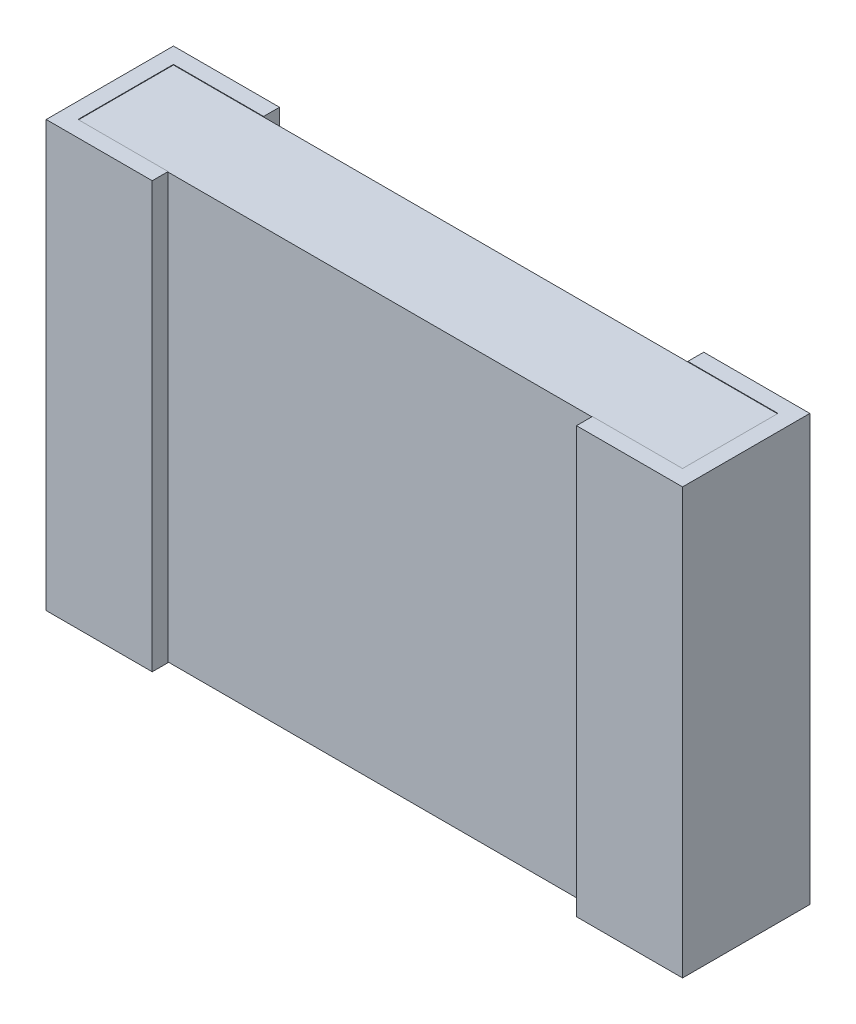
ISO-10303-21;
HEADER;
FILE_DESCRIPTION(('STEP AP214'),'2;1');
FILE_NAME('part.step','',(''),(''),'','','');
FILE_SCHEMA(('AUTOMOTIVE_DESIGN { 1 0 10303 214 1 1 1 1 }'));
ENDSEC;
DATA;
#1=APPLICATION_CONTEXT('core data for automotive mechanical design processes');
#2=APPLICATION_PROTOCOL_DEFINITION('international standard','automotive_design',2000,#1);
#3=PRODUCT_CONTEXT('',#1,'mechanical');
#4=PRODUCT('Part','Part','',(#3));
#5=PRODUCT_RELATED_PRODUCT_CATEGORY('part','',(#4));
#6=PRODUCT_DEFINITION_FORMATION('','',#4);
#7=PRODUCT_DEFINITION_CONTEXT('part definition',#1,'design');
#8=PRODUCT_DEFINITION('design','',#6,#7);
#9=PRODUCT_DEFINITION_SHAPE('','',#8);
#10=(LENGTH_UNIT() NAMED_UNIT(*) SI_UNIT(.MILLI.,.METRE.));
#11=(NAMED_UNIT(*) PLANE_ANGLE_UNIT() SI_UNIT($,.RADIAN.));
#12=(NAMED_UNIT(*) SI_UNIT($,.STERADIAN.) SOLID_ANGLE_UNIT());
#13=UNCERTAINTY_MEASURE_WITH_UNIT(LENGTH_MEASURE(1.E-05),#10,'distance_accuracy_value','');
#14=(GEOMETRIC_REPRESENTATION_CONTEXT(3) GLOBAL_UNCERTAINTY_ASSIGNED_CONTEXT((#13)) GLOBAL_UNIT_ASSIGNED_CONTEXT((#10,
#11,#12)) REPRESENTATION_CONTEXT('',''));
#15=CARTESIAN_POINT('',(0.,0.,0.));
#16=DIRECTION('',(0.,0.,1.));
#17=DIRECTION('',(1.,0.,0.));
#18=AXIS2_PLACEMENT_3D('',#15,#16,#17);
#19=CARTESIAN_POINT('',(0.0762,1.016,0.533400000000122));
#20=DIRECTION('',(0.,0.,-1.));
#21=DIRECTION('',(-1.,0.,0.));
#22=AXIS2_PLACEMENT_3D('',#19,#20,#21);
#23=PLANE('',#22);
#24=DIRECTION('',(0.,1.,0.));
#25=VECTOR('',#24,1.);
#26=CARTESIAN_POINT('',(2.54,-1.01854,0.533400000000122));
#27=LINE('',#26,#25);
#28=CARTESIAN_POINT('',(2.54,-1.016,0.533400000000122));
#29=VERTEX_POINT('',#28);
#30=CARTESIAN_POINT('',(2.54,1.016,0.533400000000122));
#31=VERTEX_POINT('',#30);
#32=EDGE_CURVE('E59',#29,#31,#27,.T.);
#33=ORIENTED_EDGE('',*,*,#32,.T.);
#34=DIRECTION('',(1.,0.,0.));
#35=VECTOR('',#34,1.);
#36=CARTESIAN_POINT('',(0.0762,1.016,0.533400000000122));
#37=LINE('',#36,#35);
#38=CARTESIAN_POINT('',(0.508,1.016,0.533400000000122));
#39=VERTEX_POINT('',#38);
#40=EDGE_CURVE('E43',#39,#31,#37,.T.);
#41=ORIENTED_EDGE('',*,*,#40,.F.);
#42=DIRECTION('',(0.,1.,0.));
#43=VECTOR('',#42,1.);
#44=CARTESIAN_POINT('',(0.508,-1.01854,0.533400000000122));
#45=LINE('',#44,#43);
#46=CARTESIAN_POINT('',(0.508,-1.016,0.533400000000122));
#47=VERTEX_POINT('',#46);
#48=EDGE_CURVE('E353',#47,#39,#45,.T.);
#49=ORIENTED_EDGE('',*,*,#48,.F.);
#50=DIRECTION('',(1.,0.,0.));
#51=VECTOR('',#50,1.);
#52=CARTESIAN_POINT('',(0.0762,-1.016,0.533400000000122));
#53=LINE('',#52,#51);
#54=EDGE_CURVE('E372',#47,#29,#53,.T.);
#55=ORIENTED_EDGE('',*,*,#54,.T.);
#56=EDGE_LOOP('',(#33,#41,#49,#55));
#57=FACE_BOUND('',#56,.T.);
#58=ADVANCED_FACE('F34',(#57),#23,.F.);
#59=CARTESIAN_POINT('',(2.9718,1.016,0.0762000000001228));
#60=DIRECTION('',(0.,0.,1.));
#61=DIRECTION('',(1.,0.,0.));
#62=AXIS2_PLACEMENT_3D('',#59,#60,#61);
#63=PLANE('',#62);
#64=DIRECTION('',(0.,1.,0.));
#65=VECTOR('',#64,1.);
#66=CARTESIAN_POINT('',(2.54000000000002,-1.01854,0.0762000000001225));
#67=LINE('',#66,#65);
#68=CARTESIAN_POINT('',(2.54000000000002,-1.016,0.0762000000001225));
#69=VERTEX_POINT('',#68);
#70=CARTESIAN_POINT('',(2.54000000000002,1.016,0.0762000000001228));
#71=VERTEX_POINT('',#70);
#72=EDGE_CURVE('E279',#69,#71,#67,.T.);
#73=ORIENTED_EDGE('',*,*,#72,.F.);
#74=DIRECTION('',(-1.,0.,0.));
#75=VECTOR('',#74,1.);
#76=CARTESIAN_POINT('',(2.9718,-1.016,0.0762000000001228));
#77=LINE('',#76,#75);
#78=CARTESIAN_POINT('',(0.507999999999976,-1.016,0.0762000000001225));
#79=VERTEX_POINT('',#78);
#80=EDGE_CURVE('E370',#69,#79,#77,.T.);
#81=ORIENTED_EDGE('',*,*,#80,.T.);
#82=DIRECTION('',(0.,1.,0.));
#83=VECTOR('',#82,1.);
#84=CARTESIAN_POINT('',(0.507999999999976,-1.01854,0.0762000000001225));
#85=LINE('',#84,#83);
#86=CARTESIAN_POINT('',(0.507999999999976,1.016,0.0762000000001225));
#87=VERTEX_POINT('',#86);
#88=EDGE_CURVE('E340',#79,#87,#85,.T.);
#89=ORIENTED_EDGE('',*,*,#88,.T.);
#90=DIRECTION('',(-1.,0.,0.));
#91=VECTOR('',#90,1.);
#92=CARTESIAN_POINT('',(2.9718,1.016,0.0762000000001228));
#93=LINE('',#92,#91);
#94=EDGE_CURVE('E51',#71,#87,#93,.T.);
#95=ORIENTED_EDGE('',*,*,#94,.F.);
#96=EDGE_LOOP('',(#73,#81,#89,#95));
#97=FACE_BOUND('',#96,.T.);
#98=ADVANCED_FACE('F36',(#97),#63,.F.);
#99=CARTESIAN_POINT('',(0.0762000000000002,1.016,0.0762000000001225));
#100=DIRECTION('',(0.,1.,0.));
#101=DIRECTION('',(0.,0.,1.));
#102=AXIS2_PLACEMENT_3D('',#99,#100,#101);
#103=PLANE('',#102);
#104=DIRECTION('',(0.,0.,-1.));
#105=VECTOR('',#104,1.);
#106=CARTESIAN_POINT('',(0.0762,1.016,0.533400000000122));
#107=LINE('',#106,#105);
#108=CARTESIAN_POINT('',(0.0762,1.016,0.533400000000122));
#109=VERTEX_POINT('',#108);
#110=CARTESIAN_POINT('',(0.0762000000000002,1.016,0.0762000000001224));
#111=VERTEX_POINT('',#110);
#112=EDGE_CURVE('E357',#109,#111,#107,.T.);
#113=ORIENTED_EDGE('',*,*,#112,.F.);
#114=EDGE_CURVE('E11',#109,#39,#37,.T.);
#115=ORIENTED_EDGE('',*,*,#114,.T.);
#116=ORIENTED_EDGE('',*,*,#40,.T.);
#117=DIRECTION('',(-1.,0.,0.));
#118=VECTOR('',#117,1.);
#119=CARTESIAN_POINT('',(0.0762000000000002,1.016,0.533400000000122));
#120=LINE('',#119,#118);
#121=CARTESIAN_POINT('',(2.9718,1.016,0.533400000000122));
#122=VERTEX_POINT('',#121);
#123=EDGE_CURVE('E210',#122,#31,#120,.T.);
#124=ORIENTED_EDGE('',*,*,#123,.F.);
#125=DIRECTION('',(0.,0.,1.));
#126=VECTOR('',#125,1.);
#127=CARTESIAN_POINT('',(2.9718,1.016,0.0762000000001228));
#128=LINE('',#127,#126);
#129=CARTESIAN_POINT('',(2.9718,1.016,0.0762000000001228));
#130=VERTEX_POINT('',#129);
#131=EDGE_CURVE('E361',#130,#122,#128,.T.);
#132=ORIENTED_EDGE('',*,*,#131,.F.);
#133=EDGE_CURVE('E359',#130,#71,#93,.T.);
#134=ORIENTED_EDGE('',*,*,#133,.T.);
#135=ORIENTED_EDGE('',*,*,#94,.T.);
#136=DIRECTION('',(-1.,0.,0.));
#137=VECTOR('',#136,1.);
#138=CARTESIAN_POINT('',(0.0762000000000002,1.016,0.0762000000001224));
#139=LINE('',#138,#137);
#140=EDGE_CURVE('E352',#87,#111,#139,.T.);
#141=ORIENTED_EDGE('',*,*,#140,.T.);
#142=EDGE_LOOP('',(#113,#115,#116,#124,#132,#134,#135,#141));
#143=FACE_BOUND('',#142,.T.);
#144=ADVANCED_FACE('F389',(#143),#103,.T.);
#145=CARTESIAN_POINT('',(0.0762000000000002,-1.016,0.0762000000001225));
#146=DIRECTION('',(0.,1.,0.));
#147=DIRECTION('',(0.,0.,1.));
#148=AXIS2_PLACEMENT_3D('',#145,#146,#147);
#149=PLANE('',#148);
#150=DIRECTION('',(0.,0.,-1.));
#151=VECTOR('',#150,1.);
#152=CARTESIAN_POINT('',(0.0762,-1.016,0.533400000000122));
#153=LINE('',#152,#151);
#154=CARTESIAN_POINT('',(0.0762,-1.016,0.533400000000122));
#155=VERTEX_POINT('',#154);
#156=CARTESIAN_POINT('',(0.0762000000000002,-1.016,0.0762000000001225));
#157=VERTEX_POINT('',#156);
#158=EDGE_CURVE('E356',#155,#157,#153,.T.);
#159=ORIENTED_EDGE('',*,*,#158,.T.);
#160=EDGE_CURVE('E366',#79,#157,#77,.T.);
#161=ORIENTED_EDGE('',*,*,#160,.F.);
#162=ORIENTED_EDGE('',*,*,#80,.F.);
#163=CARTESIAN_POINT('',(2.9718,-1.016,0.0762000000001228));
#164=VERTEX_POINT('',#163);
#165=EDGE_CURVE('E367',#164,#69,#77,.T.);
#166=ORIENTED_EDGE('',*,*,#165,.F.);
#167=DIRECTION('',(0.,0.,1.));
#168=VECTOR('',#167,1.);
#169=CARTESIAN_POINT('',(2.9718,-1.016,0.0762000000001228));
#170=LINE('',#169,#168);
#171=CARTESIAN_POINT('',(2.9718,-1.016,0.533400000000122));
#172=VERTEX_POINT('',#171);
#173=EDGE_CURVE('E369',#164,#172,#170,.T.);
#174=ORIENTED_EDGE('',*,*,#173,.T.);
#175=EDGE_CURVE('E206',#29,#172,#53,.T.);
#176=ORIENTED_EDGE('',*,*,#175,.F.);
#177=ORIENTED_EDGE('',*,*,#54,.F.);
#178=EDGE_CURVE('E38',#155,#47,#53,.T.);
#179=ORIENTED_EDGE('',*,*,#178,.F.);
#180=EDGE_LOOP('',(#159,#161,#162,#166,#174,#176,#177,#179));
#181=FACE_BOUND('',#180,.T.);
#182=ADVANCED_FACE('F386',(#181),#149,.F.);
#183=CARTESIAN_POINT('',(0.0762,-1.01854,0.533400000000122));
#184=DIRECTION('',(0.,0.,1.));
#185=DIRECTION('',(1.,0.,0.));
#186=AXIS2_PLACEMENT_3D('',#183,#184,#185);
#187=PLANE('',#186);
#188=DIRECTION('',(0.,1.,0.));
#189=VECTOR('',#188,1.);
#190=CARTESIAN_POINT('',(0.0762,-1.01854,0.533400000000122));
#191=LINE('',#190,#189);
#192=CARTESIAN_POINT('',(0.0762,-1.01854,0.533400000000122));
#193=VERTEX_POINT('',#192);
#194=EDGE_CURVE('E329',#193,#155,#191,.T.);
#195=ORIENTED_EDGE('',*,*,#194,.T.);
#196=ORIENTED_EDGE('',*,*,#178,.T.);
#197=CARTESIAN_POINT('',(0.508,-1.01854,0.533400000000122));
#198=VERTEX_POINT('',#197);
#199=EDGE_CURVE('E349',#198,#47,#45,.T.);
#200=ORIENTED_EDGE('',*,*,#199,.F.);
#201=DIRECTION('',(1.,0.,0.));
#202=VECTOR('',#201,1.);
#203=CARTESIAN_POINT('',(0.0762,-1.01854,0.533400000000122));
#204=LINE('',#203,#202);
#205=EDGE_CURVE('E284',#193,#198,#204,.T.);
#206=ORIENTED_EDGE('',*,*,#205,.F.);
#207=EDGE_LOOP('',(#195,#196,#200,#206));
#208=FACE_BOUND('',#207,.T.);
#209=ADVANCED_FACE('F376',(#208),#187,.F.);
#210=CARTESIAN_POINT('',(0.507999999999976,-1.01854,0.0762000000001225));
#211=DIRECTION('',(0.,0.,-1.));
#212=DIRECTION('',(-1.,0.,0.));
#213=AXIS2_PLACEMENT_3D('',#210,#211,#212);
#214=PLANE('',#213);
#215=CARTESIAN_POINT('',(0.507999999999976,-1.01854,0.0762000000001225));
#216=VERTEX_POINT('',#215);
#217=EDGE_CURVE('E336',#216,#79,#85,.T.);
#218=ORIENTED_EDGE('',*,*,#217,.T.);
#219=ORIENTED_EDGE('',*,*,#160,.T.);
#220=DIRECTION('',(0.,1.,0.));
#221=VECTOR('',#220,1.);
#222=CARTESIAN_POINT('',(0.0762000000000002,-1.01854,0.0762000000001224));
#223=LINE('',#222,#221);
#224=CARTESIAN_POINT('',(0.0762000000000002,-1.01854,0.0762000000001224));
#225=VERTEX_POINT('',#224);
#226=EDGE_CURVE('E333',#225,#157,#223,.T.);
#227=ORIENTED_EDGE('',*,*,#226,.F.);
#228=DIRECTION('',(-1.,0.,0.));
#229=VECTOR('',#228,1.);
#230=CARTESIAN_POINT('',(0.507999999999976,-1.01854,0.0762000000001225));
#231=LINE('',#230,#229);
#232=EDGE_CURVE('E302',#216,#225,#231,.T.);
#233=ORIENTED_EDGE('',*,*,#232,.F.);
#234=EDGE_LOOP('',(#218,#219,#227,#233));
#235=FACE_BOUND('',#234,.T.);
#236=ADVANCED_FACE('F395',(#235),#214,.F.);
#237=CARTESIAN_POINT('',(0.0762000000000002,-1.01854,0.0762000000001224));
#238=DIRECTION('',(-1.,0.,0.));
#239=DIRECTION('',(0.,0.,1.));
#240=AXIS2_PLACEMENT_3D('',#237,#238,#239);
#241=PLANE('',#240);
#242=ORIENTED_EDGE('',*,*,#226,.T.);
#243=ORIENTED_EDGE('',*,*,#158,.F.);
#244=ORIENTED_EDGE('',*,*,#194,.F.);
#245=DIRECTION('',(0.,0.,1.));
#246=VECTOR('',#245,1.);
#247=CARTESIAN_POINT('',(0.0762000000000002,-1.01854,0.0762000000001224));
#248=LINE('',#247,#246);
#249=EDGE_CURVE('E304',#225,#193,#248,.T.);
#250=ORIENTED_EDGE('',*,*,#249,.F.);
#251=EDGE_LOOP('',(#242,#243,#244,#250));
#252=FACE_BOUND('',#251,.T.);
#253=ADVANCED_FACE('F481',(#252),#241,.F.);
#254=ORIENTED_EDGE('',*,*,#114,.F.);
#255=CARTESIAN_POINT('',(0.0762,1.01854,0.533400000000122));
#256=VERTEX_POINT('',#255);
#257=EDGE_CURVE('E306',#109,#256,#191,.T.);
#258=ORIENTED_EDGE('',*,*,#257,.T.);
#259=DIRECTION('',(1.,0.,0.));
#260=VECTOR('',#259,1.);
#261=CARTESIAN_POINT('',(0.0762,1.01854,0.533400000000122));
#262=LINE('',#261,#260);
#263=CARTESIAN_POINT('',(0.508,1.01854,0.533400000000122));
#264=VERTEX_POINT('',#263);
#265=EDGE_CURVE('E283',#256,#264,#262,.T.);
#266=ORIENTED_EDGE('',*,*,#265,.T.);
#267=EDGE_CURVE('E348',#39,#264,#45,.T.);
#268=ORIENTED_EDGE('',*,*,#267,.F.);
#269=EDGE_LOOP('',(#254,#258,#266,#268));
#270=FACE_BOUND('',#269,.T.);
#271=ADVANCED_FACE('F397',(#270),#187,.F.);
#272=CARTESIAN_POINT('',(0.508,-1.01854,0.609599999999878));
#273=DIRECTION('',(1.,0.,0.));
#274=DIRECTION('',(0.,0.,-1.));
#275=AXIS2_PLACEMENT_3D('',#272,#273,#274);
#276=PLANE('',#275);
#277=DIRECTION('',(0.,0.,-1.));
#278=VECTOR('',#277,1.);
#279=CARTESIAN_POINT('',(0.508,1.01854,0.609599999999878));
#280=LINE('',#279,#278);
#281=CARTESIAN_POINT('',(0.508,1.01854,0.609599999999878));
#282=VERTEX_POINT('',#281);
#283=EDGE_CURVE('E309',#282,#264,#280,.T.);
#284=ORIENTED_EDGE('',*,*,#283,.F.);
#285=DIRECTION('',(0.,1.,0.));
#286=VECTOR('',#285,1.);
#287=CARTESIAN_POINT('',(0.508,-1.01854,0.609599999999878));
#288=LINE('',#287,#286);
#289=CARTESIAN_POINT('',(0.508,-1.01854,0.609599999999878));
#290=VERTEX_POINT('',#289);
#291=EDGE_CURVE('E346',#290,#282,#288,.T.);
#292=ORIENTED_EDGE('',*,*,#291,.F.);
#293=DIRECTION('',(0.,0.,-1.));
#294=VECTOR('',#293,1.);
#295=CARTESIAN_POINT('',(0.508,-1.01854,0.609599999999878));
#296=LINE('',#295,#294);
#297=EDGE_CURVE('E286',#290,#198,#296,.T.);
#298=ORIENTED_EDGE('',*,*,#297,.T.);
#299=ORIENTED_EDGE('',*,*,#199,.T.);
#300=ORIENTED_EDGE('',*,*,#48,.T.);
#301=ORIENTED_EDGE('',*,*,#267,.T.);
#302=EDGE_LOOP('',(#284,#292,#298,#299,#300,#301));
#303=FACE_BOUND('',#302,.T.);
#304=ADVANCED_FACE('F384',(#303),#276,.T.);
#305=CARTESIAN_POINT('',(0.,-1.01854,0.609599999999878));
#306=DIRECTION('',(0.,0.,1.));
#307=DIRECTION('',(1.,0.,0.));
#308=AXIS2_PLACEMENT_3D('',#305,#306,#307);
#309=PLANE('',#308);
#310=DIRECTION('',(1.,0.,0.));
#311=VECTOR('',#310,1.);
#312=CARTESIAN_POINT('',(0.,1.01854,0.609599999999878));
#313=LINE('',#312,#311);
#314=CARTESIAN_POINT('',(0.,1.01854,0.609599999999878));
#315=VERTEX_POINT('',#314);
#316=EDGE_CURVE('E312',#315,#282,#313,.T.);
#317=ORIENTED_EDGE('',*,*,#316,.F.);
#318=DIRECTION('',(0.,1.,0.));
#319=VECTOR('',#318,1.);
#320=CARTESIAN_POINT('',(0.,-1.01854,0.609599999999878));
#321=LINE('',#320,#319);
#322=CARTESIAN_POINT('',(0.,-1.01854,0.609599999999878));
#323=VERTEX_POINT('',#322);
#324=EDGE_CURVE('E344',#323,#315,#321,.T.);
#325=ORIENTED_EDGE('',*,*,#324,.F.);
#326=DIRECTION('',(1.,0.,0.));
#327=VECTOR('',#326,1.);
#328=CARTESIAN_POINT('',(0.,-1.01854,0.609599999999878));
#329=LINE('',#328,#327);
#330=EDGE_CURVE('E290',#323,#290,#329,.T.);
#331=ORIENTED_EDGE('',*,*,#330,.T.);
#332=ORIENTED_EDGE('',*,*,#291,.T.);
#333=EDGE_LOOP('',(#317,#325,#331,#332));
#334=FACE_BOUND('',#333,.T.);
#335=ADVANCED_FACE('F496',(#334),#309,.T.);
#336=CARTESIAN_POINT('',(0.,-1.01854,0.));
#337=DIRECTION('',(-1.,0.,0.));
#338=DIRECTION('',(0.,0.,1.));
#339=AXIS2_PLACEMENT_3D('',#336,#337,#338);
#340=PLANE('',#339);
#341=DIRECTION('',(0.,0.,1.));
#342=VECTOR('',#341,1.);
#343=CARTESIAN_POINT('',(0.,1.01854,0.));
#344=LINE('',#343,#342);
#345=CARTESIAN_POINT('',(0.,1.01854,0.));
#346=VERTEX_POINT('',#345);
#347=EDGE_CURVE('E315',#346,#315,#344,.T.);
#348=ORIENTED_EDGE('',*,*,#347,.F.);
#349=DIRECTION('',(0.,1.,0.));
#350=VECTOR('',#349,1.);
#351=CARTESIAN_POINT('',(0.,-1.01854,0.));
#352=LINE('',#351,#350);
#353=CARTESIAN_POINT('',(0.,-1.01854,0.));
#354=VERTEX_POINT('',#353);
#355=EDGE_CURVE('E342',#354,#346,#352,.T.);
#356=ORIENTED_EDGE('',*,*,#355,.F.);
#357=DIRECTION('',(0.,0.,1.));
#358=VECTOR('',#357,1.);
#359=CARTESIAN_POINT('',(0.,-1.01854,0.));
#360=LINE('',#359,#358);
#361=EDGE_CURVE('E293',#354,#323,#360,.T.);
#362=ORIENTED_EDGE('',*,*,#361,.T.);
#363=ORIENTED_EDGE('',*,*,#324,.T.);
#364=EDGE_LOOP('',(#348,#356,#362,#363));
#365=FACE_BOUND('',#364,.T.);
#366=ADVANCED_FACE('F492',(#365),#340,.T.);
#367=CARTESIAN_POINT('',(0.507999999999976,-1.01854,0.));
#368=DIRECTION('',(0.,0.,-1.));
#369=DIRECTION('',(-1.,0.,0.));
#370=AXIS2_PLACEMENT_3D('',#367,#368,#369);
#371=PLANE('',#370);
#372=DIRECTION('',(-1.,0.,0.));
#373=VECTOR('',#372,1.);
#374=CARTESIAN_POINT('',(0.507999999999976,1.01854,0.));
#375=LINE('',#374,#373);
#376=CARTESIAN_POINT('',(0.507999999999976,1.01854,0.));
#377=VERTEX_POINT('',#376);
#378=EDGE_CURVE('E318',#377,#346,#375,.T.);
#379=ORIENTED_EDGE('',*,*,#378,.F.);
#380=DIRECTION('',(0.,1.,0.));
#381=VECTOR('',#380,1.);
#382=CARTESIAN_POINT('',(0.507999999999976,-1.01854,0.));
#383=LINE('',#382,#381);
#384=CARTESIAN_POINT('',(0.507999999999976,-1.01854,0.));
#385=VERTEX_POINT('',#384);
#386=EDGE_CURVE('E339',#385,#377,#383,.T.);
#387=ORIENTED_EDGE('',*,*,#386,.F.);
#388=DIRECTION('',(-1.,0.,0.));
#389=VECTOR('',#388,1.);
#390=CARTESIAN_POINT('',(0.507999999999976,-1.01854,0.));
#391=LINE('',#390,#389);
#392=EDGE_CURVE('E296',#385,#354,#391,.T.);
#393=ORIENTED_EDGE('',*,*,#392,.T.);
#394=ORIENTED_EDGE('',*,*,#355,.T.);
#395=EDGE_LOOP('',(#379,#387,#393,#394));
#396=FACE_BOUND('',#395,.T.);
#397=ADVANCED_FACE('F488',(#396),#371,.T.);
#398=CARTESIAN_POINT('',(0.507999999999976,-1.01854,0.0762000000001225));
#399=DIRECTION('',(1.,0.,0.));
#400=DIRECTION('',(0.,0.,-1.));
#401=AXIS2_PLACEMENT_3D('',#398,#399,#400);
#402=PLANE('',#401);
#403=DIRECTION('',(0.,0.,-1.));
#404=VECTOR('',#403,1.);
#405=CARTESIAN_POINT('',(0.507999999999976,1.01854,0.0762000000001225));
#406=LINE('',#405,#404);
#407=CARTESIAN_POINT('',(0.507999999999976,1.01854,0.0762000000001225));
#408=VERTEX_POINT('',#407);
#409=EDGE_CURVE('E321',#408,#377,#406,.T.);
#410=ORIENTED_EDGE('',*,*,#409,.F.);
#411=EDGE_CURVE('E335',#87,#408,#85,.T.);
#412=ORIENTED_EDGE('',*,*,#411,.F.);
#413=ORIENTED_EDGE('',*,*,#88,.F.);
#414=ORIENTED_EDGE('',*,*,#217,.F.);
#415=DIRECTION('',(0.,0.,-1.));
#416=VECTOR('',#415,1.);
#417=CARTESIAN_POINT('',(0.507999999999976,-1.01854,0.0762000000001225));
#418=LINE('',#417,#416);
#419=EDGE_CURVE('E299',#216,#385,#418,.T.);
#420=ORIENTED_EDGE('',*,*,#419,.T.);
#421=ORIENTED_EDGE('',*,*,#386,.T.);
#422=EDGE_LOOP('',(#410,#412,#413,#414,#420,#421));
#423=FACE_BOUND('',#422,.T.);
#424=ADVANCED_FACE('F484',(#423),#402,.T.);
#425=ORIENTED_EDGE('',*,*,#140,.F.);
#426=ORIENTED_EDGE('',*,*,#411,.T.);
#427=DIRECTION('',(-1.,0.,0.));
#428=VECTOR('',#427,1.);
#429=CARTESIAN_POINT('',(0.507999999999976,1.01854,0.0762000000001225));
#430=LINE('',#429,#428);
#431=CARTESIAN_POINT('',(0.0762000000000002,1.01854,0.0762000000001224));
#432=VERTEX_POINT('',#431);
#433=EDGE_CURVE('E324',#408,#432,#430,.T.);
#434=ORIENTED_EDGE('',*,*,#433,.T.);
#435=EDGE_CURVE('E332',#111,#432,#223,.T.);
#436=ORIENTED_EDGE('',*,*,#435,.F.);
#437=EDGE_LOOP('',(#425,#426,#434,#436));
#438=FACE_BOUND('',#437,.T.);
#439=ADVANCED_FACE('F479',(#438),#214,.F.);
#440=ORIENTED_EDGE('',*,*,#112,.T.);
#441=ORIENTED_EDGE('',*,*,#435,.T.);
#442=DIRECTION('',(0.,0.,1.));
#443=VECTOR('',#442,1.);
#444=CARTESIAN_POINT('',(0.0762000000000002,1.01854,0.0762000000001224));
#445=LINE('',#444,#443);
#446=EDGE_CURVE('E287',#432,#256,#445,.T.);
#447=ORIENTED_EDGE('',*,*,#446,.T.);
#448=ORIENTED_EDGE('',*,*,#257,.F.);
#449=EDGE_LOOP('',(#440,#441,#447,#448));
#450=FACE_BOUND('',#449,.T.);
#451=ADVANCED_FACE('F472',(#450),#241,.F.);
#452=CARTESIAN_POINT('',(0.508,-1.01854,0.533400000000122));
#453=DIRECTION('',(0.,1.,0.));
#454=DIRECTION('',(0.,0.,1.));
#455=AXIS2_PLACEMENT_3D('',#452,#453,#454);
#456=PLANE('',#455);
#457=ORIENTED_EDGE('',*,*,#205,.T.);
#458=ORIENTED_EDGE('',*,*,#297,.F.);
#459=ORIENTED_EDGE('',*,*,#330,.F.);
#460=ORIENTED_EDGE('',*,*,#361,.F.);
#461=ORIENTED_EDGE('',*,*,#392,.F.);
#462=ORIENTED_EDGE('',*,*,#419,.F.);
#463=ORIENTED_EDGE('',*,*,#232,.T.);
#464=ORIENTED_EDGE('',*,*,#249,.T.);
#465=EDGE_LOOP('',(#457,#458,#459,#460,#461,#462,#463,#464));
#466=FACE_BOUND('',#465,.T.);
#467=ADVANCED_FACE('F469',(#466),#456,.F.);
#468=CARTESIAN_POINT('',(0.508,1.01854,0.533400000000122));
#469=DIRECTION('',(0.,1.,0.));
#470=DIRECTION('',(0.,0.,1.));
#471=AXIS2_PLACEMENT_3D('',#468,#469,#470);
#472=PLANE('',#471);
#473=ORIENTED_EDGE('',*,*,#265,.F.);
#474=ORIENTED_EDGE('',*,*,#446,.F.);
#475=ORIENTED_EDGE('',*,*,#433,.F.);
#476=ORIENTED_EDGE('',*,*,#409,.T.);
#477=ORIENTED_EDGE('',*,*,#378,.T.);
#478=ORIENTED_EDGE('',*,*,#347,.T.);
#479=ORIENTED_EDGE('',*,*,#316,.T.);
#480=ORIENTED_EDGE('',*,*,#283,.T.);
#481=EDGE_LOOP('',(#473,#474,#475,#476,#477,#478,#479,#480));
#482=FACE_BOUND('',#481,.T.);
#483=ADVANCED_FACE('F467',(#482),#472,.T.);
#484=CARTESIAN_POINT('',(2.9718,-1.01854,0.533400000000122));
#485=DIRECTION('',(0.,0.,-1.));
#486=DIRECTION('',(-1.,0.,0.));
#487=AXIS2_PLACEMENT_3D('',#484,#485,#486);
#488=PLANE('',#487);
#489=ORIENTED_EDGE('',*,*,#175,.T.);
#490=DIRECTION('',(0.,1.,0.));
#491=VECTOR('',#490,1.);
#492=CARTESIAN_POINT('',(2.9718,-1.01854,0.533400000000122));
#493=LINE('',#492,#491);
#494=CARTESIAN_POINT('',(2.9718,-1.01854,0.533400000000122));
#495=VERTEX_POINT('',#494);
#496=EDGE_CURVE('E201',#495,#172,#493,.T.);
#497=ORIENTED_EDGE('',*,*,#496,.F.);
#498=DIRECTION('',(-1.,0.,0.));
#499=VECTOR('',#498,1.);
#500=CARTESIAN_POINT('',(2.9718,-1.01854,0.533400000000122));
#501=LINE('',#500,#499);
#502=CARTESIAN_POINT('',(2.54,-1.01854,0.533400000000122));
#503=VERTEX_POINT('',#502);
#504=EDGE_CURVE('E205',#495,#503,#501,.T.);
#505=ORIENTED_EDGE('',*,*,#504,.T.);
#506=EDGE_CURVE('E260',#503,#29,#27,.T.);
#507=ORIENTED_EDGE('',*,*,#506,.T.);
#508=EDGE_LOOP('',(#489,#497,#505,#507));
#509=FACE_BOUND('',#508,.T.);
#510=ADVANCED_FACE('F203',(#509),#488,.T.);
#511=CARTESIAN_POINT('',(2.9718,-1.01854,0.0762000000001224));
#512=DIRECTION('',(-1.,0.,0.));
#513=DIRECTION('',(0.,0.,1.));
#514=AXIS2_PLACEMENT_3D('',#511,#512,#513);
#515=PLANE('',#514);
#516=ORIENTED_EDGE('',*,*,#173,.F.);
#517=DIRECTION('',(0.,1.,0.));
#518=VECTOR('',#517,1.);
#519=CARTESIAN_POINT('',(2.9718,-1.01854,0.0762000000001224));
#520=LINE('',#519,#518);
#521=CARTESIAN_POINT('',(2.9718,-1.01854,0.0762000000001224));
#522=VERTEX_POINT('',#521);
#523=EDGE_CURVE('E226',#522,#164,#520,.T.);
#524=ORIENTED_EDGE('',*,*,#523,.F.);
#525=DIRECTION('',(0.,0.,1.));
#526=VECTOR('',#525,1.);
#527=CARTESIAN_POINT('',(2.9718,-1.01854,0.0762000000001224));
#528=LINE('',#527,#526);
#529=EDGE_CURVE('E217',#522,#495,#528,.T.);
#530=ORIENTED_EDGE('',*,*,#529,.T.);
#531=ORIENTED_EDGE('',*,*,#496,.T.);
#532=EDGE_LOOP('',(#516,#524,#530,#531));
#533=FACE_BOUND('',#532,.T.);
#534=ADVANCED_FACE('F224',(#533),#515,.T.);
#535=CARTESIAN_POINT('',(2.54000000000002,-1.01854,0.0762000000001225));
#536=DIRECTION('',(0.,0.,1.));
#537=DIRECTION('',(1.,0.,0.));
#538=AXIS2_PLACEMENT_3D('',#535,#536,#537);
#539=PLANE('',#538);
#540=ORIENTED_EDGE('',*,*,#165,.T.);
#541=CARTESIAN_POINT('',(2.54000000000002,-1.01854,0.0762000000001225));
#542=VERTEX_POINT('',#541);
#543=EDGE_CURVE('E275',#542,#69,#67,.T.);
#544=ORIENTED_EDGE('',*,*,#543,.F.);
#545=DIRECTION('',(1.,0.,0.));
#546=VECTOR('',#545,1.);
#547=CARTESIAN_POINT('',(2.54000000000002,-1.01854,0.0762000000001225));
#548=LINE('',#547,#546);
#549=EDGE_CURVE('E227',#542,#522,#548,.T.);
#550=ORIENTED_EDGE('',*,*,#549,.T.);
#551=ORIENTED_EDGE('',*,*,#523,.T.);
#552=EDGE_LOOP('',(#540,#544,#550,#551));
#553=FACE_BOUND('',#552,.T.);
#554=ADVANCED_FACE('F410',(#553),#539,.T.);
#555=CARTESIAN_POINT('',(2.9718,1.01854,0.533400000000122));
#556=VERTEX_POINT('',#555);
#557=EDGE_CURVE('E211',#122,#556,#493,.T.);
#558=ORIENTED_EDGE('',*,*,#557,.F.);
#559=ORIENTED_EDGE('',*,*,#123,.T.);
#560=CARTESIAN_POINT('',(2.54,1.01854,0.533400000000122));
#561=VERTEX_POINT('',#560);
#562=EDGE_CURVE('E240',#31,#561,#27,.T.);
#563=ORIENTED_EDGE('',*,*,#562,.T.);
#564=DIRECTION('',(-1.,0.,0.));
#565=VECTOR('',#564,1.);
#566=CARTESIAN_POINT('',(2.9718,1.01854,0.533400000000122));
#567=LINE('',#566,#565);
#568=EDGE_CURVE('E241',#556,#561,#567,.T.);
#569=ORIENTED_EDGE('',*,*,#568,.F.);
#570=EDGE_LOOP('',(#558,#559,#563,#569));
#571=FACE_BOUND('',#570,.T.);
#572=ADVANCED_FACE('F436',(#571),#488,.T.);
#573=CARTESIAN_POINT('',(2.9718,1.01854,0.0762000000001224));
#574=VERTEX_POINT('',#573);
#575=EDGE_CURVE('E278',#130,#574,#520,.T.);
#576=ORIENTED_EDGE('',*,*,#575,.F.);
#577=ORIENTED_EDGE('',*,*,#131,.T.);
#578=ORIENTED_EDGE('',*,*,#557,.T.);
#579=DIRECTION('',(0.,0.,1.));
#580=VECTOR('',#579,1.);
#581=CARTESIAN_POINT('',(2.9718,1.01854,0.0762000000001224));
#582=LINE('',#581,#580);
#583=EDGE_CURVE('E244',#574,#556,#582,.T.);
#584=ORIENTED_EDGE('',*,*,#583,.F.);
#585=EDGE_LOOP('',(#576,#577,#578,#584));
#586=FACE_BOUND('',#585,.T.);
#587=ADVANCED_FACE('F444',(#586),#515,.T.);
#588=CARTESIAN_POINT('',(2.54000000000002,1.01854,0.0762000000001225));
#589=VERTEX_POINT('',#588);
#590=EDGE_CURVE('E274',#71,#589,#67,.T.);
#591=ORIENTED_EDGE('',*,*,#590,.F.);
#592=ORIENTED_EDGE('',*,*,#133,.F.);
#593=ORIENTED_EDGE('',*,*,#575,.T.);
#594=DIRECTION('',(1.,0.,0.));
#595=VECTOR('',#594,1.);
#596=CARTESIAN_POINT('',(2.54000000000002,1.01854,0.0762000000001225));
#597=LINE('',#596,#595);
#598=EDGE_CURVE('E247',#589,#574,#597,.T.);
#599=ORIENTED_EDGE('',*,*,#598,.F.);
#600=EDGE_LOOP('',(#591,#592,#593,#599));
#601=FACE_BOUND('',#600,.T.);
#602=ADVANCED_FACE('F449',(#601),#539,.T.);
#603=CARTESIAN_POINT('',(2.54000000000002,-1.01854,0.0762000000001225));
#604=DIRECTION('',(1.,0.,0.));
#605=DIRECTION('',(0.,0.,-1.));
#606=AXIS2_PLACEMENT_3D('',#603,#604,#605);
#607=PLANE('',#606);
#608=DIRECTION('',(0.,0.,-1.));
#609=VECTOR('',#608,1.);
#610=CARTESIAN_POINT('',(2.54000000000002,1.01854,0.0762000000001225));
#611=LINE('',#610,#609);
#612=CARTESIAN_POINT('',(2.54000000000002,1.01854,0.));
#613=VERTEX_POINT('',#612);
#614=EDGE_CURVE('E250',#589,#613,#611,.T.);
#615=ORIENTED_EDGE('',*,*,#614,.T.);
#616=DIRECTION('',(0.,1.,0.));
#617=VECTOR('',#616,1.);
#618=CARTESIAN_POINT('',(2.54000000000002,-1.01854,0.));
#619=LINE('',#618,#617);
#620=CARTESIAN_POINT('',(2.54000000000002,-1.01854,0.));
#621=VERTEX_POINT('',#620);
#622=EDGE_CURVE('E271',#621,#613,#619,.T.);
#623=ORIENTED_EDGE('',*,*,#622,.F.);
#624=DIRECTION('',(0.,0.,-1.));
#625=VECTOR('',#624,1.);
#626=CARTESIAN_POINT('',(2.54000000000002,-1.01854,0.0762000000001225));
#627=LINE('',#626,#625);
#628=EDGE_CURVE('E229',#542,#621,#627,.T.);
#629=ORIENTED_EDGE('',*,*,#628,.F.);
#630=ORIENTED_EDGE('',*,*,#543,.T.);
#631=ORIENTED_EDGE('',*,*,#72,.T.);
#632=ORIENTED_EDGE('',*,*,#590,.T.);
#633=EDGE_LOOP('',(#615,#623,#629,#630,#631,#632));
#634=FACE_BOUND('',#633,.T.);
#635=ADVANCED_FACE('F412',(#634),#607,.F.);
#636=CARTESIAN_POINT('',(2.54000000000002,-1.01854,0.));
#637=DIRECTION('',(0.,0.,1.));
#638=DIRECTION('',(1.,0.,0.));
#639=AXIS2_PLACEMENT_3D('',#636,#637,#638);
#640=PLANE('',#639);
#641=DIRECTION('',(1.,0.,0.));
#642=VECTOR('',#641,1.);
#643=CARTESIAN_POINT('',(2.54000000000002,1.01854,0.));
#644=LINE('',#643,#642);
#645=CARTESIAN_POINT('',(3.048,1.01854,0.));
#646=VERTEX_POINT('',#645);
#647=EDGE_CURVE('E252',#613,#646,#644,.T.);
#648=ORIENTED_EDGE('',*,*,#647,.T.);
#649=DIRECTION('',(0.,1.,0.));
#650=VECTOR('',#649,1.);
#651=CARTESIAN_POINT('',(3.048,-1.01854,0.));
#652=LINE('',#651,#650);
#653=CARTESIAN_POINT('',(3.048,-1.01854,0.));
#654=VERTEX_POINT('',#653);
#655=EDGE_CURVE('E268',#654,#646,#652,.T.);
#656=ORIENTED_EDGE('',*,*,#655,.F.);
#657=DIRECTION('',(1.,0.,0.));
#658=VECTOR('',#657,1.);
#659=CARTESIAN_POINT('',(2.54000000000002,-1.01854,0.));
#660=LINE('',#659,#658);
#661=EDGE_CURVE('E233',#621,#654,#660,.T.);
#662=ORIENTED_EDGE('',*,*,#661,.F.);
#663=ORIENTED_EDGE('',*,*,#622,.T.);
#664=EDGE_LOOP('',(#648,#656,#662,#663));
#665=FACE_BOUND('',#664,.T.);
#666=ADVANCED_FACE('F419',(#665),#640,.F.);
#667=CARTESIAN_POINT('',(3.048,-1.01854,0.));
#668=DIRECTION('',(-1.,0.,0.));
#669=DIRECTION('',(0.,0.,1.));
#670=AXIS2_PLACEMENT_3D('',#667,#668,#669);
#671=PLANE('',#670);
#672=DIRECTION('',(0.,0.,1.));
#673=VECTOR('',#672,1.);
#674=CARTESIAN_POINT('',(3.048,1.01854,0.));
#675=LINE('',#674,#673);
#676=CARTESIAN_POINT('',(3.048,1.01854,0.609599999999878));
#677=VERTEX_POINT('',#676);
#678=EDGE_CURVE('E254',#646,#677,#675,.T.);
#679=ORIENTED_EDGE('',*,*,#678,.T.);
#680=DIRECTION('',(0.,1.,0.));
#681=VECTOR('',#680,1.);
#682=CARTESIAN_POINT('',(3.048,-1.01854,0.609599999999878));
#683=LINE('',#682,#681);
#684=CARTESIAN_POINT('',(3.048,-1.01854,0.609599999999878));
#685=VERTEX_POINT('',#684);
#686=EDGE_CURVE('E265',#685,#677,#683,.T.);
#687=ORIENTED_EDGE('',*,*,#686,.F.);
#688=DIRECTION('',(0.,0.,1.));
#689=VECTOR('',#688,1.);
#690=CARTESIAN_POINT('',(3.048,-1.01854,0.));
#691=LINE('',#690,#689);
#692=EDGE_CURVE('E235',#654,#685,#691,.T.);
#693=ORIENTED_EDGE('',*,*,#692,.F.);
#694=ORIENTED_EDGE('',*,*,#655,.T.);
#695=EDGE_LOOP('',(#679,#687,#693,#694));
#696=FACE_BOUND('',#695,.T.);
#697=ADVANCED_FACE('F423',(#696),#671,.F.);
#698=CARTESIAN_POINT('',(3.048,-1.01854,0.609599999999878));
#699=DIRECTION('',(0.,0.,-1.));
#700=DIRECTION('',(-1.,0.,0.));
#701=AXIS2_PLACEMENT_3D('',#698,#699,#700);
#702=PLANE('',#701);
#703=DIRECTION('',(-1.,0.,0.));
#704=VECTOR('',#703,1.);
#705=CARTESIAN_POINT('',(3.048,1.01854,0.609599999999878));
#706=LINE('',#705,#704);
#707=CARTESIAN_POINT('',(2.54,1.01854,0.609599999999878));
#708=VERTEX_POINT('',#707);
#709=EDGE_CURVE('E256',#677,#708,#706,.T.);
#710=ORIENTED_EDGE('',*,*,#709,.T.);
#711=DIRECTION('',(0.,1.,0.));
#712=VECTOR('',#711,1.);
#713=CARTESIAN_POINT('',(2.54,-1.01854,0.609599999999878));
#714=LINE('',#713,#712);
#715=CARTESIAN_POINT('',(2.54,-1.01854,0.609599999999878));
#716=VERTEX_POINT('',#715);
#717=EDGE_CURVE('E262',#716,#708,#714,.T.);
#718=ORIENTED_EDGE('',*,*,#717,.F.);
#719=DIRECTION('',(-1.,0.,0.));
#720=VECTOR('',#719,1.);
#721=CARTESIAN_POINT('',(3.048,-1.01854,0.609599999999878));
#722=LINE('',#721,#720);
#723=EDGE_CURVE('E237',#685,#716,#722,.T.);
#724=ORIENTED_EDGE('',*,*,#723,.F.);
#725=ORIENTED_EDGE('',*,*,#686,.T.);
#726=EDGE_LOOP('',(#710,#718,#724,#725));
#727=FACE_BOUND('',#726,.T.);
#728=ADVANCED_FACE('F428',(#727),#702,.F.);
#729=CARTESIAN_POINT('',(2.54,-1.01854,0.609599999999878));
#730=DIRECTION('',(1.,0.,0.));
#731=DIRECTION('',(0.,0.,-1.));
#732=AXIS2_PLACEMENT_3D('',#729,#730,#731);
#733=PLANE('',#732);
#734=DIRECTION('',(0.,0.,-1.));
#735=VECTOR('',#734,1.);
#736=CARTESIAN_POINT('',(2.54,1.01854,0.609599999999878));
#737=LINE('',#736,#735);
#738=EDGE_CURVE('E222',#708,#561,#737,.T.);
#739=ORIENTED_EDGE('',*,*,#738,.T.);
#740=ORIENTED_EDGE('',*,*,#562,.F.);
#741=ORIENTED_EDGE('',*,*,#32,.F.);
#742=ORIENTED_EDGE('',*,*,#506,.F.);
#743=DIRECTION('',(0.,0.,-1.));
#744=VECTOR('',#743,1.);
#745=CARTESIAN_POINT('',(2.54,-1.01854,0.609599999999878));
#746=LINE('',#745,#744);
#747=EDGE_CURVE('E220',#716,#503,#746,.T.);
#748=ORIENTED_EDGE('',*,*,#747,.F.);
#749=ORIENTED_EDGE('',*,*,#717,.T.);
#750=EDGE_LOOP('',(#739,#740,#741,#742,#748,#749));
#751=FACE_BOUND('',#750,.T.);
#752=ADVANCED_FACE('F431',(#751),#733,.F.);
#753=CARTESIAN_POINT('',(2.54,-1.01854,0.533400000000122));
#754=DIRECTION('',(0.,1.,0.));
#755=DIRECTION('',(0.,0.,1.));
#756=AXIS2_PLACEMENT_3D('',#753,#754,#755);
#757=PLANE('',#756);
#758=ORIENTED_EDGE('',*,*,#504,.F.);
#759=ORIENTED_EDGE('',*,*,#529,.F.);
#760=ORIENTED_EDGE('',*,*,#549,.F.);
#761=ORIENTED_EDGE('',*,*,#628,.T.);
#762=ORIENTED_EDGE('',*,*,#661,.T.);
#763=ORIENTED_EDGE('',*,*,#692,.T.);
#764=ORIENTED_EDGE('',*,*,#723,.T.);
#765=ORIENTED_EDGE('',*,*,#747,.T.);
#766=EDGE_LOOP('',(#758,#759,#760,#761,#762,#763,#764,#765));
#767=FACE_BOUND('',#766,.T.);
#768=ADVANCED_FACE('F215',(#767),#757,.F.);
#769=CARTESIAN_POINT('',(2.54,1.01854,0.533400000000122));
#770=DIRECTION('',(0.,1.,0.));
#771=DIRECTION('',(0.,0.,1.));
#772=AXIS2_PLACEMENT_3D('',#769,#770,#771);
#773=PLANE('',#772);
#774=ORIENTED_EDGE('',*,*,#568,.T.);
#775=ORIENTED_EDGE('',*,*,#738,.F.);
#776=ORIENTED_EDGE('',*,*,#709,.F.);
#777=ORIENTED_EDGE('',*,*,#678,.F.);
#778=ORIENTED_EDGE('',*,*,#647,.F.);
#779=ORIENTED_EDGE('',*,*,#614,.F.);
#780=ORIENTED_EDGE('',*,*,#598,.T.);
#781=ORIENTED_EDGE('',*,*,#583,.T.);
#782=EDGE_LOOP('',(#774,#775,#776,#777,#778,#779,#780,#781));
#783=FACE_BOUND('',#782,.T.);
#784=ADVANCED_FACE('F438',(#783),#773,.T.);
#785=CLOSED_SHELL('',(#58,#98,#144,#182,#209,#236,#253,#271,#304,#335,#366,#397,#424,#439,#451,
#467,#483,#510,#534,#554,#572,#587,#602,#635,#666,#697,#728,#752,#768,#784));
#786=MANIFOLD_SOLID_BREP('B2',#785);
#787=ADVANCED_BREP_SHAPE_REPRESENTATION('',(#18,#786),#14);
#788=SHAPE_DEFINITION_REPRESENTATION(#9,#787);
ENDSEC;
END-ISO-10303-21;
